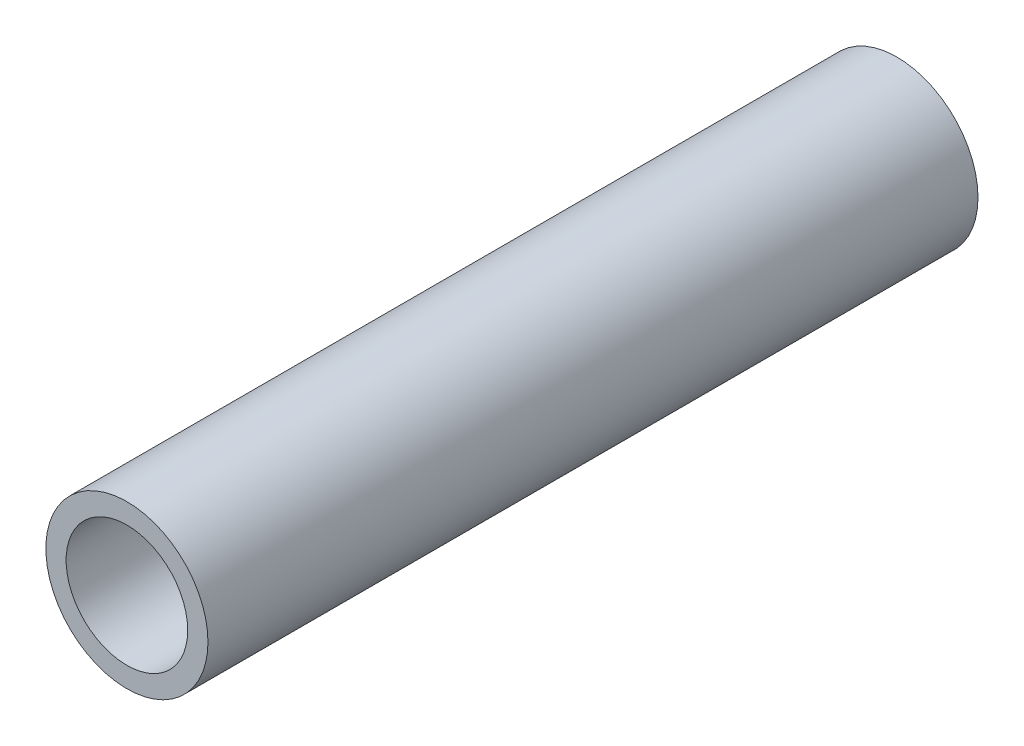
ISO-10303-21;
HEADER;
FILE_DESCRIPTION(('STEP AP214'),'2;1');
FILE_NAME('part.step','',(''),(''),'','','');
FILE_SCHEMA(('AUTOMOTIVE_DESIGN { 1 0 10303 214 1 1 1 1 }'));
ENDSEC;
DATA;
#1=APPLICATION_CONTEXT('core data for automotive mechanical design processes');
#2=APPLICATION_PROTOCOL_DEFINITION('international standard','automotive_design',2000,#1);
#3=PRODUCT_CONTEXT('',#1,'mechanical');
#4=PRODUCT('Part','Part','',(#3));
#5=PRODUCT_RELATED_PRODUCT_CATEGORY('part','',(#4));
#6=PRODUCT_DEFINITION_FORMATION('','',#4);
#7=PRODUCT_DEFINITION_CONTEXT('part definition',#1,'design');
#8=PRODUCT_DEFINITION('design','',#6,#7);
#9=PRODUCT_DEFINITION_SHAPE('','',#8);
#10=(LENGTH_UNIT() NAMED_UNIT(*) SI_UNIT(.MILLI.,.METRE.));
#11=(NAMED_UNIT(*) PLANE_ANGLE_UNIT() SI_UNIT($,.RADIAN.));
#12=(NAMED_UNIT(*) SI_UNIT($,.STERADIAN.) SOLID_ANGLE_UNIT());
#13=UNCERTAINTY_MEASURE_WITH_UNIT(LENGTH_MEASURE(1.E-05),#10,'distance_accuracy_value','');
#14=(GEOMETRIC_REPRESENTATION_CONTEXT(3) GLOBAL_UNCERTAINTY_ASSIGNED_CONTEXT((#13)) GLOBAL_UNIT_ASSIGNED_CONTEXT((#10,
#11,#12)) REPRESENTATION_CONTEXT('',''));
#15=CARTESIAN_POINT('',(0.,0.,0.));
#16=DIRECTION('',(0.,0.,1.));
#17=DIRECTION('',(1.,0.,0.));
#18=AXIS2_PLACEMENT_3D('',#15,#16,#17);
#19=CARTESIAN_POINT('',(0.,0.,38.));
#20=DIRECTION('',(0.,0.,1.));
#21=DIRECTION('',(1.,0.,0.));
#22=AXIS2_PLACEMENT_3D('',#19,#20,#21);
#23=PLANE('',#22);
#24=CARTESIAN_POINT('',(0.,0.,38.));
#25=DIRECTION('',(0.,0.,1.));
#26=DIRECTION('',(1.,0.,0.));
#27=AXIS2_PLACEMENT_3D('',#24,#25,#26);
#28=CIRCLE('',#27,4.);
#29=CARTESIAN_POINT('',(4.,0.,38.));
#30=VERTEX_POINT('',#29);
#31=EDGE_CURVE('E10',#30,#30,#28,.T.);
#32=ORIENTED_EDGE('',*,*,#31,.T.);
#33=EDGE_LOOP('',(#32));
#34=FACE_BOUND('',#33,.T.);
#35=CARTESIAN_POINT('',(0.,0.,38.));
#36=DIRECTION('',(0.,0.,1.));
#37=DIRECTION('',(1.,0.,0.));
#38=AXIS2_PLACEMENT_3D('',#35,#36,#37);
#39=CIRCLE('',#38,3.);
#40=CARTESIAN_POINT('',(3.,0.,38.));
#41=VERTEX_POINT('',#40);
#42=EDGE_CURVE('E42',#41,#41,#39,.T.);
#43=ORIENTED_EDGE('',*,*,#42,.F.);
#44=EDGE_LOOP('',(#43));
#45=FACE_BOUND('',#44,.T.);
#46=ADVANCED_FACE('F31',(#34,#45),#23,.T.);
#47=CARTESIAN_POINT('',(0.,0.,0.));
#48=DIRECTION('',(0.,0.,1.));
#49=DIRECTION('',(1.,0.,0.));
#50=AXIS2_PLACEMENT_3D('',#47,#48,#49);
#51=PLANE('',#50);
#52=CARTESIAN_POINT('',(0.,0.,0.));
#53=DIRECTION('',(0.,0.,1.));
#54=DIRECTION('',(1.,0.,0.));
#55=AXIS2_PLACEMENT_3D('',#52,#53,#54);
#56=CIRCLE('',#55,4.);
#57=CARTESIAN_POINT('',(4.,0.,0.));
#58=VERTEX_POINT('',#57);
#59=EDGE_CURVE('E35',#58,#58,#56,.T.);
#60=ORIENTED_EDGE('',*,*,#59,.F.);
#61=EDGE_LOOP('',(#60));
#62=FACE_BOUND('',#61,.T.);
#63=CARTESIAN_POINT('',(0.,0.,0.));
#64=DIRECTION('',(0.,0.,1.));
#65=DIRECTION('',(1.,0.,0.));
#66=AXIS2_PLACEMENT_3D('',#63,#64,#65);
#67=CIRCLE('',#66,3.);
#68=CARTESIAN_POINT('',(3.,0.,0.));
#69=VERTEX_POINT('',#68);
#70=EDGE_CURVE('E44',#69,#69,#67,.T.);
#71=ORIENTED_EDGE('',*,*,#70,.T.);
#72=EDGE_LOOP('',(#71));
#73=FACE_BOUND('',#72,.T.);
#74=ADVANCED_FACE('F54',(#62,#73),#51,.F.);
#75=CARTESIAN_POINT('',(0.,0.,38.));
#76=DIRECTION('',(0.,0.,-1.));
#77=DIRECTION('',(-1.,0.,0.));
#78=AXIS2_PLACEMENT_3D('',#75,#76,#77);
#79=CYLINDRICAL_SURFACE('',#78,4.);
#80=ORIENTED_EDGE('',*,*,#31,.F.);
#81=EDGE_LOOP('',(#80));
#82=FACE_BOUND('',#81,.T.);
#83=ORIENTED_EDGE('',*,*,#59,.T.);
#84=EDGE_LOOP('',(#83));
#85=FACE_BOUND('',#84,.T.);
#86=ADVANCED_FACE('F33',(#82,#85),#79,.T.);
#87=CARTESIAN_POINT('',(0.,0.,38.));
#88=DIRECTION('',(0.,0.,-1.));
#89=DIRECTION('',(-1.,0.,0.));
#90=AXIS2_PLACEMENT_3D('',#87,#88,#89);
#91=CYLINDRICAL_SURFACE('',#90,3.);
#92=ORIENTED_EDGE('',*,*,#42,.T.);
#93=EDGE_LOOP('',(#92));
#94=FACE_BOUND('',#93,.T.);
#95=ORIENTED_EDGE('',*,*,#70,.F.);
#96=EDGE_LOOP('',(#95));
#97=FACE_BOUND('',#96,.T.);
#98=ADVANCED_FACE('F50',(#94,#97),#91,.F.);
#99=CLOSED_SHELL('',(#46,#74,#86,#98));
#100=MANIFOLD_SOLID_BREP('B2',#99);
#101=ADVANCED_BREP_SHAPE_REPRESENTATION('',(#18,#100),#14);
#102=SHAPE_DEFINITION_REPRESENTATION(#9,#101);
ENDSEC;
END-ISO-10303-21;
